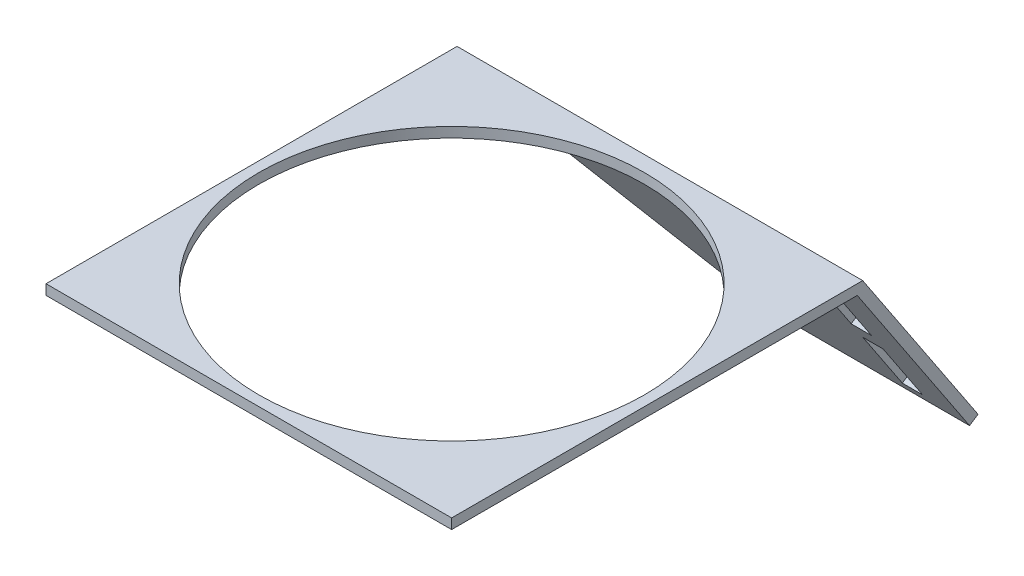
ISO-10303-21;
HEADER;
FILE_DESCRIPTION(('STEP AP214'),'2;1');
FILE_NAME('part.step','',(''),(''),'','','');
FILE_SCHEMA(('AUTOMOTIVE_DESIGN { 1 0 10303 214 1 1 1 1 }'));
ENDSEC;
DATA;
#1=APPLICATION_CONTEXT('core data for automotive mechanical design processes');
#2=APPLICATION_PROTOCOL_DEFINITION('international standard','automotive_design',2000,#1);
#3=PRODUCT_CONTEXT('',#1,'mechanical');
#4=PRODUCT('Part','Part','',(#3));
#5=PRODUCT_RELATED_PRODUCT_CATEGORY('part','',(#4));
#6=PRODUCT_DEFINITION_FORMATION('','',#4);
#7=PRODUCT_DEFINITION_CONTEXT('part definition',#1,'design');
#8=PRODUCT_DEFINITION('design','',#6,#7);
#9=PRODUCT_DEFINITION_SHAPE('','',#8);
#10=(LENGTH_UNIT() NAMED_UNIT(*) SI_UNIT(.MILLI.,.METRE.));
#11=(NAMED_UNIT(*) PLANE_ANGLE_UNIT() SI_UNIT($,.RADIAN.));
#12=(NAMED_UNIT(*) SI_UNIT($,.STERADIAN.) SOLID_ANGLE_UNIT());
#13=UNCERTAINTY_MEASURE_WITH_UNIT(LENGTH_MEASURE(1.E-05),#10,'distance_accuracy_value','');
#14=(GEOMETRIC_REPRESENTATION_CONTEXT(3) GLOBAL_UNCERTAINTY_ASSIGNED_CONTEXT((#13)) GLOBAL_UNIT_ASSIGNED_CONTEXT((#10,
#11,#12)) REPRESENTATION_CONTEXT('',''));
#15=CARTESIAN_POINT('',(0.,0.,0.));
#16=DIRECTION('',(0.,0.,1.));
#17=DIRECTION('',(1.,0.,0.));
#18=AXIS2_PLACEMENT_3D('',#15,#16,#17);
#19=CARTESIAN_POINT('',(-4.,6.43679601982153,-58.9330956874139));
#20=DIRECTION('',(1.,0.,0.));
#21=DIRECTION('',(0.,0.,-1.));
#22=AXIS2_PLACEMENT_3D('',#19,#20,#21);
#23=PLANE('',#22);
#24=DIRECTION('',(0.,0.832717125771484,0.553698644071735));
#25=VECTOR('',#24,1.);
#26=CARTESIAN_POINT('',(-4.,-15.7111497430479,-25.6244106565546));
#27=LINE('',#26,#25);
#28=CARTESIAN_POINT('',(-4.,-15.7111497430479,-25.6244106565546));
#29=VERTEX_POINT('',#28);
#30=CARTESIAN_POINT('',(-4.,-9.84190902614033,-21.7217761050296));
#31=VERTEX_POINT('',#30);
#32=EDGE_CURVE('E48',#29,#31,#27,.T.);
#33=ORIENTED_EDGE('',*,*,#32,.T.);
#34=DIRECTION('',(0.,0.553698644071735,-0.832717125771485));
#35=VECTOR('',#34,1.);
#36=CARTESIAN_POINT('',(-4.,12.3060367367291,-55.030461135889));
#37=LINE('',#36,#35);
#38=CARTESIAN_POINT('',(-4.,-9.28821038206859,-22.5544932308011));
#39=VERTEX_POINT('',#38);
#40=EDGE_CURVE('E52',#31,#39,#37,.T.);
#41=ORIENTED_EDGE('',*,*,#40,.T.);
#42=DIRECTION('',(0.,-0.832717125771484,-0.553698644071735));
#43=VECTOR('',#42,1.);
#44=CARTESIAN_POINT('',(-4.,-16.100643871358,-27.0842850041524));
#45=LINE('',#44,#43);
#46=CARTESIAN_POINT('',(-4.,-15.1574510989761,-26.457127782326));
#47=VERTEX_POINT('',#46);
#48=EDGE_CURVE('E192',#39,#47,#45,.T.);
#49=ORIENTED_EDGE('',*,*,#48,.T.);
#50=DIRECTION('',(0.,-0.553698644071735,0.832717125771484));
#51=VECTOR('',#50,1.);
#52=CARTESIAN_POINT('',(-4.,6.43679601982153,-58.9330956874139));
#53=LINE('',#52,#51);
#54=EDGE_CURVE('E177',#47,#29,#53,.T.);
#55=ORIENTED_EDGE('',*,*,#54,.T.);
#56=EDGE_LOOP('',(#33,#41,#49,#55));
#57=FACE_BOUND('',#56,.T.);
#58=ADVANCED_FACE('F33',(#57),#23,.F.);
#59=CARTESIAN_POINT('',(-6.,6.43679601982153,-58.9330956874139));
#60=DIRECTION('',(-1.,0.,0.));
#61=DIRECTION('',(0.,0.,1.));
#62=AXIS2_PLACEMENT_3D('',#59,#60,#61);
#63=PLANE('',#62);
#64=DIRECTION('',(0.,0.832717125771484,0.553698644071735));
#65=VECTOR('',#64,1.);
#66=CARTESIAN_POINT('',(-6.00000000000001,-16.100643871358,-27.0842850041524));
#67=LINE('',#66,#65);
#68=CARTESIAN_POINT('',(-6.,-15.1574510989761,-26.4571277823261));
#69=VERTEX_POINT('',#68);
#70=CARTESIAN_POINT('',(-6.00000000000001,-9.28821038206859,-22.5544932308011));
#71=VERTEX_POINT('',#70);
#72=EDGE_CURVE('E188',#69,#71,#67,.T.);
#73=ORIENTED_EDGE('',*,*,#72,.T.);
#74=DIRECTION('',(0.,-0.553698644071735,0.832717125771485));
#75=VECTOR('',#74,1.);
#76=CARTESIAN_POINT('',(-6.,12.3060367367291,-55.030461135889));
#77=LINE('',#76,#75);
#78=CARTESIAN_POINT('',(-6.,-9.84190902614033,-21.7217761050296));
#79=VERTEX_POINT('',#78);
#80=EDGE_CURVE('E11',#71,#79,#77,.T.);
#81=ORIENTED_EDGE('',*,*,#80,.T.);
#82=DIRECTION('',(0.,-0.832717125771484,-0.553698644071735));
#83=VECTOR('',#82,1.);
#84=CARTESIAN_POINT('',(-6.,-15.7111497430479,-25.6244106565546));
#85=LINE('',#84,#83);
#86=CARTESIAN_POINT('',(-6.,-15.7111497430479,-25.6244106565546));
#87=VERTEX_POINT('',#86);
#88=EDGE_CURVE('E170',#79,#87,#85,.T.);
#89=ORIENTED_EDGE('',*,*,#88,.T.);
#90=DIRECTION('',(0.,-0.553698644071735,0.832717125771484));
#91=VECTOR('',#90,1.);
#92=CARTESIAN_POINT('',(-6.,6.43679601982153,-58.9330956874139));
#93=LINE('',#92,#91);
#94=EDGE_CURVE('E180',#69,#87,#93,.T.);
#95=ORIENTED_EDGE('',*,*,#94,.F.);
#96=EDGE_LOOP('',(#73,#81,#89,#95));
#97=FACE_BOUND('',#96,.T.);
#98=ADVANCED_FACE('F274',(#97),#63,.F.);
#99=CARTESIAN_POINT('',(0.,1.,0.));
#100=DIRECTION('',(0.,1.,0.));
#101=DIRECTION('',(0.,0.,1.));
#102=AXIS2_PLACEMENT_3D('',#99,#100,#101);
#103=PLANE('',#102);
#104=DIRECTION('',(0.,0.,1.));
#105=VECTOR('',#104,1.);
#106=CARTESIAN_POINT('',(-40.,1.,-15.1775949969462));
#107=LINE('',#106,#105);
#108=CARTESIAN_POINT('',(-40.,1.,-15.7135529376632));
#109=VERTEX_POINT('',#108);
#110=CARTESIAN_POINT('',(-40.,1.,24.8224050030538));
#111=VERTEX_POINT('',#110);
#112=EDGE_CURVE('E228',#109,#111,#107,.T.);
#113=ORIENTED_EDGE('',*,*,#112,.T.);
#114=DIRECTION('',(1.,0.,0.));
#115=VECTOR('',#114,1.);
#116=CARTESIAN_POINT('',(-40.,1.,24.8224050030538));
#117=LINE('',#116,#115);
#118=CARTESIAN_POINT('',(0.,1.,24.8224050030538));
#119=VERTEX_POINT('',#118);
#120=EDGE_CURVE('E231',#111,#119,#117,.T.);
#121=ORIENTED_EDGE('',*,*,#120,.T.);
#122=DIRECTION('',(0.,0.,-1.));
#123=VECTOR('',#122,1.);
#124=CARTESIAN_POINT('',(0.,1.,-15.1775949969462));
#125=LINE('',#124,#123);
#126=CARTESIAN_POINT('',(0.,1.,-15.7135529376632));
#127=VERTEX_POINT('',#126);
#128=EDGE_CURVE('E234',#119,#127,#125,.T.);
#129=ORIENTED_EDGE('',*,*,#128,.T.);
#130=DIRECTION('',(1.,0.,0.));
#131=VECTOR('',#130,1.);
#132=CARTESIAN_POINT('',(-40.,1.,-15.7135529376632));
#133=LINE('',#132,#131);
#134=EDGE_CURVE('E215',#109,#127,#133,.T.);
#135=ORIENTED_EDGE('',*,*,#134,.F.);
#136=EDGE_LOOP('',(#113,#121,#129,#135));
#137=FACE_BOUND('',#136,.T.);
#138=CARTESIAN_POINT('',(-20.,1.,4.82240500305377));
#139=DIRECTION('',(0.,1.,0.));
#140=DIRECTION('',(0.,0.,1.));
#141=AXIS2_PLACEMENT_3D('',#138,#139,#140);
#142=CIRCLE('',#141,19.);
#143=CARTESIAN_POINT('',(-20.,1.,23.8224050030538));
#144=VERTEX_POINT('',#143);
#145=EDGE_CURVE('E222',#144,#144,#142,.T.);
#146=ORIENTED_EDGE('',*,*,#145,.F.);
#147=EDGE_LOOP('',(#146));
#148=FACE_BOUND('',#147,.T.);
#149=ADVANCED_FACE('F276',(#137,#148),#103,.T.);
#150=CARTESIAN_POINT('',(0.,0.,0.));
#151=DIRECTION('',(0.,1.,0.));
#152=DIRECTION('',(0.,0.,1.));
#153=AXIS2_PLACEMENT_3D('',#150,#151,#152);
#154=PLANE('',#153);
#155=DIRECTION('',(0.,0.,1.));
#156=VECTOR('',#155,1.);
#157=CARTESIAN_POINT('',(-40.,0.,-15.1775949969462));
#158=LINE('',#157,#156);
#159=CARTESIAN_POINT('',(-40.,0.,-15.1775949969462));
#160=VERTEX_POINT('',#159);
#161=CARTESIAN_POINT('',(-40.,0.,24.8224050030538));
#162=VERTEX_POINT('',#161);
#163=EDGE_CURVE('E225',#160,#162,#158,.T.);
#164=ORIENTED_EDGE('',*,*,#163,.F.);
#165=DIRECTION('',(-1.,0.,0.));
#166=VECTOR('',#165,1.);
#167=CARTESIAN_POINT('',(-40.,0.,-15.1775949969462));
#168=LINE('',#167,#166);
#169=CARTESIAN_POINT('',(0.,0.,-15.1775949969462));
#170=VERTEX_POINT('',#169);
#171=EDGE_CURVE('E232',#170,#160,#168,.T.);
#172=ORIENTED_EDGE('',*,*,#171,.F.);
#173=DIRECTION('',(0.,0.,-1.));
#174=VECTOR('',#173,1.);
#175=CARTESIAN_POINT('',(0.,0.,-15.1775949969462));
#176=LINE('',#175,#174);
#177=CARTESIAN_POINT('',(0.,0.,24.8224050030538));
#178=VERTEX_POINT('',#177);
#179=EDGE_CURVE('E241',#178,#170,#176,.T.);
#180=ORIENTED_EDGE('',*,*,#179,.F.);
#181=DIRECTION('',(1.,0.,0.));
#182=VECTOR('',#181,1.);
#183=CARTESIAN_POINT('',(-40.,0.,24.8224050030538));
#184=LINE('',#183,#182);
#185=EDGE_CURVE('E239',#162,#178,#184,.T.);
#186=ORIENTED_EDGE('',*,*,#185,.F.);
#187=EDGE_LOOP('',(#164,#172,#180,#186));
#188=FACE_BOUND('',#187,.T.);
#189=CARTESIAN_POINT('',(-20.,0.,4.82240500305377));
#190=DIRECTION('',(0.,1.,0.));
#191=DIRECTION('',(0.,0.,1.));
#192=AXIS2_PLACEMENT_3D('',#189,#190,#191);
#193=CIRCLE('',#192,19.);
#194=CARTESIAN_POINT('',(-20.,0.,23.8224050030538));
#195=VERTEX_POINT('',#194);
#196=EDGE_CURVE('E218',#195,#195,#193,.T.);
#197=ORIENTED_EDGE('',*,*,#196,.T.);
#198=EDGE_LOOP('',(#197));
#199=FACE_BOUND('',#198,.T.);
#200=ADVANCED_FACE('F282',(#188,#199),#154,.F.);
#201=CARTESIAN_POINT('',(-40.,1.,-15.1775949969462));
#202=DIRECTION('',(1.,0.,0.));
#203=DIRECTION('',(0.,0.,-1.));
#204=AXIS2_PLACEMENT_3D('',#201,#202,#203);
#205=PLANE('',#204);
#206=DIRECTION('',(0.,0.832717125771484,0.553698644071735));
#207=VECTOR('',#206,1.);
#208=CARTESIAN_POINT('',(-40.,-16.100643871358,-27.0842850041524));
#209=LINE('',#208,#207);
#210=CARTESIAN_POINT('',(-40.,0.553698644071731,-16.0103121227177));
#211=VERTEX_POINT('',#210);
#212=EDGE_CURVE('E204',#211,#109,#209,.T.);
#213=ORIENTED_EDGE('',*,*,#212,.F.);
#214=DIRECTION('',(0.,-0.553698644071735,0.832717125771484));
#215=VECTOR('',#214,1.);
#216=CARTESIAN_POINT('',(-40.,22.1479457628694,-48.4862800278056));
#217=LINE('',#216,#215);
#218=EDGE_CURVE('E197',#211,#160,#217,.T.);
#219=ORIENTED_EDGE('',*,*,#218,.T.);
#220=ORIENTED_EDGE('',*,*,#163,.T.);
#221=DIRECTION('',(0.,-1.,0.));
#222=VECTOR('',#221,1.);
#223=CARTESIAN_POINT('',(-40.,1.,24.8224050030538));
#224=LINE('',#223,#222);
#225=EDGE_CURVE('E248',#111,#162,#224,.T.);
#226=ORIENTED_EDGE('',*,*,#225,.F.);
#227=ORIENTED_EDGE('',*,*,#112,.F.);
#228=EDGE_LOOP('',(#213,#219,#220,#226,#227));
#229=FACE_BOUND('',#228,.T.);
#230=ADVANCED_FACE('F35',(#229),#205,.F.);
#231=CARTESIAN_POINT('',(-40.,1.,24.8224050030538));
#232=DIRECTION('',(0.,0.,-1.));
#233=DIRECTION('',(-1.,0.,0.));
#234=AXIS2_PLACEMENT_3D('',#231,#232,#233);
#235=PLANE('',#234);
#236=ORIENTED_EDGE('',*,*,#185,.T.);
#237=DIRECTION('',(0.,-1.,0.));
#238=VECTOR('',#237,1.);
#239=CARTESIAN_POINT('',(0.,1.,24.8224050030538));
#240=LINE('',#239,#238);
#241=EDGE_CURVE('E236',#119,#178,#240,.T.);
#242=ORIENTED_EDGE('',*,*,#241,.F.);
#243=ORIENTED_EDGE('',*,*,#120,.F.);
#244=ORIENTED_EDGE('',*,*,#225,.T.);
#245=EDGE_LOOP('',(#236,#242,#243,#244));
#246=FACE_BOUND('',#245,.T.);
#247=ADVANCED_FACE('F389',(#246),#235,.F.);
#248=CARTESIAN_POINT('',(0.,1.,-15.1775949969462));
#249=DIRECTION('',(-1.,0.,0.));
#250=DIRECTION('',(0.,0.,1.));
#251=AXIS2_PLACEMENT_3D('',#248,#249,#250);
#252=PLANE('',#251);
#253=ORIENTED_EDGE('',*,*,#179,.T.);
#254=DIRECTION('',(0.,-0.832717125771485,-0.553698644071735));
#255=VECTOR('',#254,1.);
#256=CARTESIAN_POINT('',(0.,0.,-15.1775949969462));
#257=LINE('',#256,#255);
#258=CARTESIAN_POINT('',(0.,-16.6543425154297,-26.2515678783809));
#259=VERTEX_POINT('',#258);
#260=EDGE_CURVE('E203',#170,#259,#257,.T.);
#261=ORIENTED_EDGE('',*,*,#260,.T.);
#262=DIRECTION('',(0.,0.553698644071734,-0.832717125771485));
#263=VECTOR('',#262,1.);
#264=CARTESIAN_POINT('',(0.,-16.6543425154297,-26.2515678783809));
#265=LINE('',#264,#263);
#266=CARTESIAN_POINT('',(0.,-16.100643871358,-27.0842850041524));
#267=VERTEX_POINT('',#266);
#268=EDGE_CURVE('E210',#259,#267,#265,.T.);
#269=ORIENTED_EDGE('',*,*,#268,.T.);
#270=DIRECTION('',(0.,0.832717125771484,0.553698644071735));
#271=VECTOR('',#270,1.);
#272=CARTESIAN_POINT('',(0.,-16.100643871358,-27.0842850041524));
#273=LINE('',#272,#271);
#274=EDGE_CURVE('E207',#267,#127,#273,.T.);
#275=ORIENTED_EDGE('',*,*,#274,.T.);
#276=ORIENTED_EDGE('',*,*,#128,.F.);
#277=ORIENTED_EDGE('',*,*,#241,.T.);
#278=EDGE_LOOP('',(#253,#261,#269,#275,#276,#277));
#279=FACE_BOUND('',#278,.T.);
#280=ADVANCED_FACE('F407',(#279),#252,.F.);
#281=CARTESIAN_POINT('',(-20.,1.,4.82240500305377));
#282=DIRECTION('',(0.,-1.,0.));
#283=DIRECTION('',(0.,0.,-1.));
#284=AXIS2_PLACEMENT_3D('',#281,#282,#283);
#285=CYLINDRICAL_SURFACE('',#284,19.);
#286=ORIENTED_EDGE('',*,*,#145,.T.);
#287=EDGE_LOOP('',(#286));
#288=FACE_BOUND('',#287,.T.);
#289=ORIENTED_EDGE('',*,*,#196,.F.);
#290=EDGE_LOOP('',(#289));
#291=FACE_BOUND('',#290,.T.);
#292=ADVANCED_FACE('F338',(#288,#291),#285,.F.);
#293=CARTESIAN_POINT('',(-40.,-16.100643871358,-27.0842850041524));
#294=DIRECTION('',(0.,0.553698644071735,-0.832717125771484));
#295=DIRECTION('',(0.,0.832717125771484,0.553698644071735));
#296=AXIS2_PLACEMENT_3D('',#293,#294,#295);
#297=PLANE('',#296);
#298=ORIENTED_EDGE('',*,*,#48,.F.);
#299=DIRECTION('',(1.,0.,0.));
#300=VECTOR('',#299,1.);
#301=CARTESIAN_POINT('',(-3.04562725591495,-9.28821038206859,-22.5544932308011));
#302=LINE('',#301,#300);
#303=EDGE_CURVE('E156',#71,#39,#302,.T.);
#304=ORIENTED_EDGE('',*,*,#303,.F.);
#305=ORIENTED_EDGE('',*,*,#72,.F.);
#306=DIRECTION('',(-1.,0.,0.));
#307=VECTOR('',#306,1.);
#308=CARTESIAN_POINT('',(-40.,-15.1574510989761,-26.457127782326));
#309=LINE('',#308,#307);
#310=EDGE_CURVE('E190',#47,#69,#309,.T.);
#311=ORIENTED_EDGE('',*,*,#310,.F.);
#312=EDGE_LOOP('',(#298,#304,#305,#311));
#313=FACE_BOUND('',#312,.T.);
#314=CARTESIAN_POINT('',(-6.00000000000001,-7.57274430628827,-21.4138282790258));
#315=VERTEX_POINT('',#314);
#316=CARTESIAN_POINT('',(-6.00000000000001,-0.202518078029052,-16.5131433491845));
#317=VERTEX_POINT('',#316);
#318=EDGE_CURVE('E187',#315,#317,#67,.T.);
#319=ORIENTED_EDGE('',*,*,#318,.F.);
#320=DIRECTION('',(-1.,0.,0.));
#321=VECTOR('',#320,1.);
#322=CARTESIAN_POINT('',(-3.04562725591495,-7.57274430628827,-21.4138282790258));
#323=LINE('',#322,#321);
#324=CARTESIAN_POINT('',(-4.,-7.57274430628827,-21.4138282790258));
#325=VERTEX_POINT('',#324);
#326=EDGE_CURVE('E163',#325,#315,#323,.T.);
#327=ORIENTED_EDGE('',*,*,#326,.F.);
#328=CARTESIAN_POINT('',(-4.,-0.202518078029047,-16.5131433491845));
#329=VERTEX_POINT('',#328);
#330=EDGE_CURVE('E152',#329,#325,#45,.T.);
#331=ORIENTED_EDGE('',*,*,#330,.F.);
#332=DIRECTION('',(1.,0.,0.));
#333=VECTOR('',#332,1.);
#334=CARTESIAN_POINT('',(-40.,-0.202518078029054,-16.5131433491845));
#335=LINE('',#334,#333);
#336=EDGE_CURVE('E179',#317,#329,#335,.T.);
#337=ORIENTED_EDGE('',*,*,#336,.F.);
#338=EDGE_LOOP('',(#319,#327,#331,#337));
#339=FACE_BOUND('',#338,.T.);
#340=DIRECTION('',(0.707106781186548,-0.588819926443188,-0.391524065956921));
#341=VECTOR('',#340,1.);
#342=CARTESIAN_POINT('',(-30.,-7.77347261364311,-21.5472985634351));
#343=LINE('',#342,#341);
#344=CARTESIAN_POINT('',(-20.,-16.1006438713579,-27.0842850041524));
#345=VERTEX_POINT('',#344);
#346=EDGE_CURVE('E200',#211,#345,#343,.T.);
#347=ORIENTED_EDGE('',*,*,#346,.F.);
#348=ORIENTED_EDGE('',*,*,#212,.T.);
#349=ORIENTED_EDGE('',*,*,#134,.T.);
#350=ORIENTED_EDGE('',*,*,#274,.F.);
#351=DIRECTION('',(1.,0.,0.));
#352=VECTOR('',#351,1.);
#353=CARTESIAN_POINT('',(-40.,-16.100643871358,-27.0842850041524));
#354=LINE('',#353,#352);
#355=EDGE_CURVE('E219',#345,#267,#354,.T.);
#356=ORIENTED_EDGE('',*,*,#355,.F.);
#357=EDGE_LOOP('',(#347,#348,#349,#350,#356));
#358=FACE_BOUND('',#357,.T.);
#359=ADVANCED_FACE('F256',(#313,#339,#358),#297,.T.);
#360=CARTESIAN_POINT('',(-40.,-16.6543425154297,-26.2515678783809));
#361=DIRECTION('',(0.,-0.832717125771485,-0.553698644071734));
#362=DIRECTION('',(0.,0.553698644071734,-0.832717125771485));
#363=AXIS2_PLACEMENT_3D('',#360,#361,#362);
#364=PLANE('',#363);
#365=DIRECTION('',(0.,-0.553698644071735,0.832717125771484));
#366=VECTOR('',#365,1.);
#367=CARTESIAN_POINT('',(-20.,5.4936032474397,-59.5602529092403));
#368=LINE('',#367,#366);
#369=CARTESIAN_POINT('',(-20.,-16.6543425154297,-26.2515678783809));
#370=VERTEX_POINT('',#369);
#371=EDGE_CURVE('E196',#345,#370,#368,.T.);
#372=ORIENTED_EDGE('',*,*,#371,.F.);
#373=ORIENTED_EDGE('',*,*,#355,.T.);
#374=ORIENTED_EDGE('',*,*,#268,.F.);
#375=DIRECTION('',(1.,0.,0.));
#376=VECTOR('',#375,1.);
#377=CARTESIAN_POINT('',(-40.,-16.6543425154297,-26.2515678783809));
#378=LINE('',#377,#376);
#379=EDGE_CURVE('E206',#370,#259,#378,.T.);
#380=ORIENTED_EDGE('',*,*,#379,.F.);
#381=EDGE_LOOP('',(#372,#373,#374,#380));
#382=FACE_BOUND('',#381,.T.);
#383=ADVANCED_FACE('F324',(#382),#364,.T.);
#384=CARTESIAN_POINT('',(-40.,0.,-15.1775949969462));
#385=DIRECTION('',(0.,-0.553698644071735,0.832717125771485));
#386=DIRECTION('',(0.,-0.832717125771485,-0.553698644071735));
#387=AXIS2_PLACEMENT_3D('',#384,#385,#386);
#388=PLANE('',#387);
#389=ORIENTED_EDGE('',*,*,#88,.F.);
#390=DIRECTION('',(1.,0.,0.));
#391=VECTOR('',#390,1.);
#392=CARTESIAN_POINT('',(-3.04562725591495,-9.84190902614033,-21.7217761050296));
#393=LINE('',#392,#391);
#394=EDGE_CURVE('E160',#79,#31,#393,.T.);
#395=ORIENTED_EDGE('',*,*,#394,.T.);
#396=ORIENTED_EDGE('',*,*,#32,.F.);
#397=DIRECTION('',(1.,0.,0.));
#398=VECTOR('',#397,1.);
#399=CARTESIAN_POINT('',(-4.,-15.7111497430479,-25.6244106565546));
#400=LINE('',#399,#398);
#401=EDGE_CURVE('E173',#87,#29,#400,.T.);
#402=ORIENTED_EDGE('',*,*,#401,.F.);
#403=EDGE_LOOP('',(#389,#395,#396,#402));
#404=FACE_BOUND('',#403,.T.);
#405=CARTESIAN_POINT('',(-4.,-8.12644295036001,-20.5811111532543));
#406=VERTEX_POINT('',#405);
#407=CARTESIAN_POINT('',(-4.,-0.756216722100785,-15.680426223413));
#408=VERTEX_POINT('',#407);
#409=EDGE_CURVE('E135',#406,#408,#27,.T.);
#410=ORIENTED_EDGE('',*,*,#409,.F.);
#411=DIRECTION('',(-1.,0.,0.));
#412=VECTOR('',#411,1.);
#413=CARTESIAN_POINT('',(-3.04562725591495,-8.12644295036001,-20.5811111532543));
#414=LINE('',#413,#412);
#415=CARTESIAN_POINT('',(-6.,-8.12644295036,-20.5811111532543));
#416=VERTEX_POINT('',#415);
#417=EDGE_CURVE('E141',#406,#416,#414,.T.);
#418=ORIENTED_EDGE('',*,*,#417,.T.);
#419=CARTESIAN_POINT('',(-6.,-0.756216722100783,-15.680426223413));
#420=VERTEX_POINT('',#419);
#421=EDGE_CURVE('E171',#420,#416,#85,.T.);
#422=ORIENTED_EDGE('',*,*,#421,.F.);
#423=DIRECTION('',(-1.,0.,0.));
#424=VECTOR('',#423,1.);
#425=CARTESIAN_POINT('',(-4.,-0.756216722100783,-15.680426223413));
#426=LINE('',#425,#424);
#427=EDGE_CURVE('E143',#408,#420,#426,.T.);
#428=ORIENTED_EDGE('',*,*,#427,.F.);
#429=EDGE_LOOP('',(#410,#418,#422,#428));
#430=FACE_BOUND('',#429,.T.);
#431=DIRECTION('',(-0.707106781186548,0.588819926443188,0.39152406595692));
#432=VECTOR('',#431,1.);
#433=CARTESIAN_POINT('',(-20.,-16.6543425154297,-26.2515678783809));
#434=LINE('',#433,#432);
#435=EDGE_CURVE('E194',#370,#160,#434,.T.);
#436=ORIENTED_EDGE('',*,*,#435,.F.);
#437=ORIENTED_EDGE('',*,*,#379,.T.);
#438=ORIENTED_EDGE('',*,*,#260,.F.);
#439=ORIENTED_EDGE('',*,*,#171,.T.);
#440=EDGE_LOOP('',(#436,#437,#438,#439));
#441=FACE_BOUND('',#440,.T.);
#442=ADVANCED_FACE('F137',(#404,#430,#441),#388,.T.);
#443=CARTESIAN_POINT('',(-20.,5.4936032474397,-59.5602529092403));
#444=DIRECTION('',(0.707106781186547,0.588819926443188,0.39152406595692));
#445=DIRECTION('',(-0.639904898610702,0.768454111013811,0.));
#446=AXIS2_PLACEMENT_3D('',#443,#444,#445);
#447=PLANE('',#446);
#448=ORIENTED_EDGE('',*,*,#346,.T.);
#449=ORIENTED_EDGE('',*,*,#371,.T.);
#450=ORIENTED_EDGE('',*,*,#435,.T.);
#451=ORIENTED_EDGE('',*,*,#218,.F.);
#452=EDGE_LOOP('',(#448,#449,#450,#451));
#453=FACE_BOUND('',#452,.T.);
#454=ADVANCED_FACE('F298',(#453),#447,.F.);
#455=ORIENTED_EDGE('',*,*,#330,.T.);
#456=DIRECTION('',(0.,-0.553698644071735,0.832717125771485));
#457=VECTOR('',#456,1.);
#458=CARTESIAN_POINT('',(-4.,14.0215028125094,-53.8897961841137));
#459=LINE('',#458,#457);
#460=EDGE_CURVE('E149',#325,#406,#459,.T.);
#461=ORIENTED_EDGE('',*,*,#460,.T.);
#462=ORIENTED_EDGE('',*,*,#409,.T.);
#463=DIRECTION('',(0.,-0.553698644071735,0.832717125771484));
#464=VECTOR('',#463,1.);
#465=CARTESIAN_POINT('',(-4.,21.3917290407686,-48.9891112542724));
#466=LINE('',#465,#464);
#467=EDGE_CURVE('E176',#329,#408,#466,.T.);
#468=ORIENTED_EDGE('',*,*,#467,.F.);
#469=EDGE_LOOP('',(#455,#461,#462,#468));
#470=FACE_BOUND('',#469,.T.);
#471=ADVANCED_FACE('F150',(#470),#23,.F.);
#472=CARTESIAN_POINT('',(-4.,6.43679601982153,-58.9330956874139));
#473=DIRECTION('',(0.,-0.832717125771484,-0.553698644071735));
#474=DIRECTION('',(0.,0.553698644071735,-0.832717125771484));
#475=AXIS2_PLACEMENT_3D('',#472,#473,#474);
#476=PLANE('',#475);
#477=ORIENTED_EDGE('',*,*,#310,.T.);
#478=ORIENTED_EDGE('',*,*,#94,.T.);
#479=ORIENTED_EDGE('',*,*,#401,.T.);
#480=ORIENTED_EDGE('',*,*,#54,.F.);
#481=EDGE_LOOP('',(#477,#478,#479,#480));
#482=FACE_BOUND('',#481,.T.);
#483=ADVANCED_FACE('F269',(#482),#476,.F.);
#484=ORIENTED_EDGE('',*,*,#421,.T.);
#485=DIRECTION('',(0.,0.553698644071735,-0.832717125771485));
#486=VECTOR('',#485,1.);
#487=CARTESIAN_POINT('',(-6.,14.0215028125094,-53.8897961841137));
#488=LINE('',#487,#486);
#489=EDGE_CURVE('E41',#416,#315,#488,.T.);
#490=ORIENTED_EDGE('',*,*,#489,.T.);
#491=ORIENTED_EDGE('',*,*,#318,.T.);
#492=DIRECTION('',(0.,-0.553698644071735,0.832717125771484));
#493=VECTOR('',#492,1.);
#494=CARTESIAN_POINT('',(-6.,21.3917290407686,-48.9891112542724));
#495=LINE('',#494,#493);
#496=EDGE_CURVE('E183',#317,#420,#495,.T.);
#497=ORIENTED_EDGE('',*,*,#496,.T.);
#498=EDGE_LOOP('',(#484,#490,#491,#497));
#499=FACE_BOUND('',#498,.T.);
#500=ADVANCED_FACE('F252',(#499),#63,.F.);
#501=CARTESIAN_POINT('',(-4.,21.3917290407686,-48.9891112542724));
#502=DIRECTION('',(0.,0.832717125771484,0.553698644071735));
#503=DIRECTION('',(0.,-0.553698644071735,0.832717125771484));
#504=AXIS2_PLACEMENT_3D('',#501,#502,#503);
#505=PLANE('',#504);
#506=ORIENTED_EDGE('',*,*,#336,.T.);
#507=ORIENTED_EDGE('',*,*,#467,.T.);
#508=ORIENTED_EDGE('',*,*,#427,.T.);
#509=ORIENTED_EDGE('',*,*,#496,.F.);
#510=EDGE_LOOP('',(#506,#507,#508,#509));
#511=FACE_BOUND('',#510,.T.);
#512=ADVANCED_FACE('F289',(#511),#505,.F.);
#513=CARTESIAN_POINT('',(-3.04562725591495,-9.28821038206859,-22.5544932308011));
#514=DIRECTION('',(0.,-0.832717125771485,-0.553698644071735));
#515=DIRECTION('',(0.,0.553698644071735,-0.832717125771485));
#516=AXIS2_PLACEMENT_3D('',#513,#514,#515);
#517=PLANE('',#516);
#518=ORIENTED_EDGE('',*,*,#40,.F.);
#519=ORIENTED_EDGE('',*,*,#394,.F.);
#520=ORIENTED_EDGE('',*,*,#80,.F.);
#521=ORIENTED_EDGE('',*,*,#303,.T.);
#522=EDGE_LOOP('',(#518,#519,#520,#521));
#523=FACE_BOUND('',#522,.T.);
#524=ADVANCED_FACE('F262',(#523),#517,.T.);
#525=CARTESIAN_POINT('',(-3.04562725591495,-7.57274430628827,-21.4138282790258));
#526=DIRECTION('',(0.,0.832717125771485,0.553698644071735));
#527=DIRECTION('',(0.,-0.553698644071735,0.832717125771485));
#528=AXIS2_PLACEMENT_3D('',#525,#526,#527);
#529=PLANE('',#528);
#530=ORIENTED_EDGE('',*,*,#460,.F.);
#531=ORIENTED_EDGE('',*,*,#326,.T.);
#532=ORIENTED_EDGE('',*,*,#489,.F.);
#533=ORIENTED_EDGE('',*,*,#417,.F.);
#534=EDGE_LOOP('',(#530,#531,#532,#533));
#535=FACE_BOUND('',#534,.T.);
#536=ADVANCED_FACE('F159',(#535),#529,.T.);
#537=CLOSED_SHELL('',(#58,#98,#149,#200,#230,#247,#280,#292,#359,#383,#442,#454,#471,#483,#500,
#512,#524,#536));
#538=MANIFOLD_SOLID_BREP('B2',#537);
#539=ADVANCED_BREP_SHAPE_REPRESENTATION('',(#18,#538),#14);
#540=SHAPE_DEFINITION_REPRESENTATION(#9,#539);
ENDSEC;
END-ISO-10303-21;
